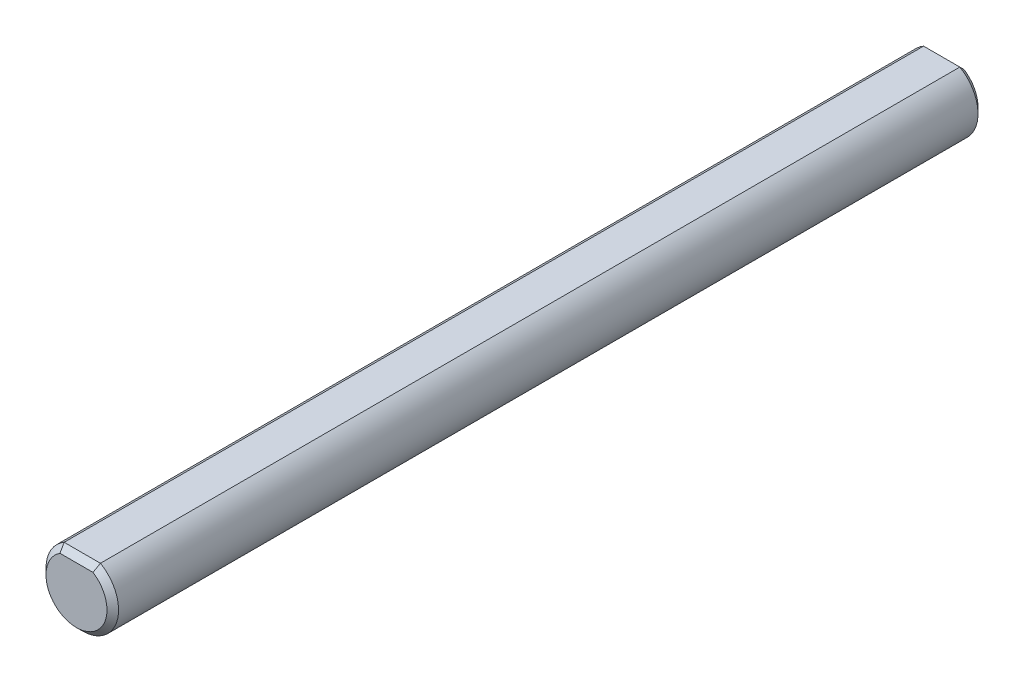
ISO-10303-21;
HEADER;
FILE_DESCRIPTION(('STEP AP214'),'2;1');
FILE_NAME('part.step','',(''),(''),'','','');
FILE_SCHEMA(('AUTOMOTIVE_DESIGN { 1 0 10303 214 1 1 1 1 }'));
ENDSEC;
DATA;
#1=APPLICATION_CONTEXT('core data for automotive mechanical design processes');
#2=APPLICATION_PROTOCOL_DEFINITION('international standard','automotive_design',2000,#1);
#3=PRODUCT_CONTEXT('',#1,'mechanical');
#4=PRODUCT('Part','Part','',(#3));
#5=PRODUCT_RELATED_PRODUCT_CATEGORY('part','',(#4));
#6=PRODUCT_DEFINITION_FORMATION('','',#4);
#7=PRODUCT_DEFINITION_CONTEXT('part definition',#1,'design');
#8=PRODUCT_DEFINITION('design','',#6,#7);
#9=PRODUCT_DEFINITION_SHAPE('','',#8);
#10=(LENGTH_UNIT() NAMED_UNIT(*) SI_UNIT(.MILLI.,.METRE.));
#11=(NAMED_UNIT(*) PLANE_ANGLE_UNIT() SI_UNIT($,.RADIAN.));
#12=(NAMED_UNIT(*) SI_UNIT($,.STERADIAN.) SOLID_ANGLE_UNIT());
#13=UNCERTAINTY_MEASURE_WITH_UNIT(LENGTH_MEASURE(1.E-05),#10,'distance_accuracy_value','');
#14=(GEOMETRIC_REPRESENTATION_CONTEXT(3) GLOBAL_UNCERTAINTY_ASSIGNED_CONTEXT((#13)) GLOBAL_UNIT_ASSIGNED_CONTEXT((#10,
#11,#12)) REPRESENTATION_CONTEXT('',''));
#15=CARTESIAN_POINT('',(0.,0.,0.));
#16=DIRECTION('',(0.,0.,1.));
#17=DIRECTION('',(1.,0.,0.));
#18=AXIS2_PLACEMENT_3D('',#15,#16,#17);
#19=CARTESIAN_POINT('',(0.,0.,76.2));
#20=DIRECTION('',(0.,0.,-1.));
#21=DIRECTION('',(-1.,0.,0.));
#22=AXIS2_PLACEMENT_3D('',#19,#20,#21);
#23=CYLINDRICAL_SURFACE('',#22,3.175);
#24=DIRECTION('',(0.,0.,-1.));
#25=VECTOR('',#24,1.);
#26=CARTESIAN_POINT('',(1.5875,2.74963065701559,76.2));
#27=LINE('',#26,#25);
#28=CARTESIAN_POINT('',(1.5875,2.74963065701559,75.692));
#29=VERTEX_POINT('',#28);
#30=CARTESIAN_POINT('',(1.5875,2.74963065701559,0.508000000000064));
#31=VERTEX_POINT('',#30);
#32=EDGE_CURVE('E109',#29,#31,#27,.T.);
#33=ORIENTED_EDGE('',*,*,#32,.F.);
#34=CARTESIAN_POINT('',(0.,0.,75.692));
#35=DIRECTION('',(0.,0.,1.));
#36=DIRECTION('',(1.,0.,0.));
#37=AXIS2_PLACEMENT_3D('',#34,#35,#36);
#38=CIRCLE('',#37,3.175);
#39=CARTESIAN_POINT('',(-1.5875,2.74963065701559,75.692));
#40=VERTEX_POINT('',#39);
#41=EDGE_CURVE('E125',#29,#40,#38,.F.);
#42=ORIENTED_EDGE('',*,*,#41,.T.);
#43=DIRECTION('',(0.,0.,-1.));
#44=VECTOR('',#43,1.);
#45=CARTESIAN_POINT('',(-1.5875,2.74963065701559,76.2));
#46=LINE('',#45,#44);
#47=CARTESIAN_POINT('',(-1.5875,2.74963065701559,0.508000000000064));
#48=VERTEX_POINT('',#47);
#49=EDGE_CURVE('E168',#40,#48,#46,.T.);
#50=ORIENTED_EDGE('',*,*,#49,.T.);
#51=CARTESIAN_POINT('',(0.,0.,0.508000000000036));
#52=DIRECTION('',(0.,0.,1.));
#53=DIRECTION('',(1.,0.,0.));
#54=AXIS2_PLACEMENT_3D('',#51,#52,#53);
#55=CIRCLE('',#54,3.175);
#56=EDGE_CURVE('E122',#48,#31,#55,.T.);
#57=ORIENTED_EDGE('',*,*,#56,.T.);
#58=EDGE_LOOP('',(#33,#42,#50,#57));
#59=FACE_BOUND('',#58,.T.);
#60=ADVANCED_FACE('F43',(#59),#23,.T.);
#61=CARTESIAN_POINT('',(-1.5875,2.74963065701559,76.2));
#62=DIRECTION('',(0.,-1.,0.));
#63=DIRECTION('',(0.,0.,-1.));
#64=AXIS2_PLACEMENT_3D('',#61,#62,#63);
#65=PLANE('',#64);
#66=ORIENTED_EDGE('',*,*,#49,.F.);
#67=DIRECTION('',(1.,0.,0.));
#68=VECTOR('',#67,1.);
#69=CARTESIAN_POINT('',(1.5875,2.74963065701559,75.692));
#70=LINE('',#69,#68);
#71=EDGE_CURVE('E98',#40,#29,#70,.T.);
#72=ORIENTED_EDGE('',*,*,#71,.T.);
#73=ORIENTED_EDGE('',*,*,#32,.T.);
#74=DIRECTION('',(-1.,0.,0.));
#75=VECTOR('',#74,1.);
#76=CARTESIAN_POINT('',(-1.5875,2.74963065701559,0.508000000000036));
#77=LINE('',#76,#75);
#78=EDGE_CURVE('E113',#31,#48,#77,.T.);
#79=ORIENTED_EDGE('',*,*,#78,.T.);
#80=EDGE_LOOP('',(#66,#72,#73,#79));
#81=FACE_BOUND('',#80,.T.);
#82=ADVANCED_FACE('F176',(#81),#65,.F.);
#83=CARTESIAN_POINT('',(0.,0.,76.2));
#84=DIRECTION('',(0.,0.,1.));
#85=DIRECTION('',(1.,0.,0.));
#86=AXIS2_PLACEMENT_3D('',#83,#84,#85);
#87=PLANE('',#86);
#88=CARTESIAN_POINT('',(0.,0.,76.2));
#89=DIRECTION('',(0.,0.,1.));
#90=DIRECTION('',(1.,0.,0.));
#91=AXIS2_PLACEMENT_3D('',#88,#89,#90);
#92=CIRCLE('',#91,2.66700000000002);
#93=CARTESIAN_POINT('',(-1.44498477415088,2.24163065701561,76.2));
#94=VERTEX_POINT('',#93);
#95=CARTESIAN_POINT('',(1.44498477415088,2.24163065701561,76.2));
#96=VERTEX_POINT('',#95);
#97=EDGE_CURVE('E105',#94,#96,#92,.T.);
#98=ORIENTED_EDGE('',*,*,#97,.T.);
#99=DIRECTION('',(-1.,0.,0.));
#100=VECTOR('',#99,1.);
#101=CARTESIAN_POINT('',(-1.5875,2.24163065701561,76.2));
#102=LINE('',#101,#100);
#103=EDGE_CURVE('E96',#96,#94,#102,.T.);
#104=ORIENTED_EDGE('',*,*,#103,.T.);
#105=EDGE_LOOP('',(#98,#104));
#106=FACE_BOUND('',#105,.T.);
#107=ADVANCED_FACE('F111',(#106),#87,.T.);
#108=CARTESIAN_POINT('',(0.,0.,0.));
#109=DIRECTION('',(0.,0.,1.));
#110=DIRECTION('',(1.,0.,0.));
#111=AXIS2_PLACEMENT_3D('',#108,#109,#110);
#112=PLANE('',#111);
#113=CARTESIAN_POINT('',(0.,0.,0.));
#114=DIRECTION('',(0.,0.,1.));
#115=DIRECTION('',(1.,0.,0.));
#116=AXIS2_PLACEMENT_3D('',#113,#114,#115);
#117=CIRCLE('',#116,2.66699999999996);
#118=CARTESIAN_POINT('',(1.44498477415086,2.24163065701555,0.));
#119=VERTEX_POINT('',#118);
#120=CARTESIAN_POINT('',(-1.44498477415086,2.24163065701555,0.));
#121=VERTEX_POINT('',#120);
#122=EDGE_CURVE('E59',#119,#121,#117,.F.);
#123=ORIENTED_EDGE('',*,*,#122,.T.);
#124=DIRECTION('',(1.,0.,0.));
#125=VECTOR('',#124,1.);
#126=CARTESIAN_POINT('',(0.,2.24163065701555,0.));
#127=LINE('',#126,#125);
#128=EDGE_CURVE('E11',#121,#119,#127,.T.);
#129=ORIENTED_EDGE('',*,*,#128,.T.);
#130=EDGE_LOOP('',(#123,#129));
#131=FACE_BOUND('',#130,.T.);
#132=ADVANCED_FACE('F187',(#131),#112,.F.);
#133=CARTESIAN_POINT('',(0.,0.,76.2));
#134=DIRECTION('',(0.,0.,-1.));
#135=DIRECTION('',(-1.,0.,0.));
#136=AXIS2_PLACEMENT_3D('',#133,#134,#135);
#137=CONICAL_SURFACE('',#136,2.66700000000002,0.785398163397438);
#138=CARTESIAN_POINT('',(-1.44498477415088,2.24163065701561,76.2));
#139=CARTESIAN_POINT('',(-1.46981082100591,2.3261468954951,76.1154837615205));
#140=CARTESIAN_POINT('',(-1.49410013308598,2.41073842223693,76.0308922347787));
#141=CARTESIAN_POINT('',(-1.54160520461424,2.58007175609694,75.8615589009187));
#142=CARTESIAN_POINT('',(-1.56482096781721,2.66481356268844,75.7768170943272));
#143=CARTESIAN_POINT('',(-1.5875,2.74963065701559,75.692));
#144=B_SPLINE_CURVE_WITH_KNOTS('',3,(#138,#139,#140,#141,#142,#143),.UNSPECIFIED.,.F.,.F.,(4,2,
4),(0.,0.366214160388622,0.732427039830236),.UNSPECIFIED.);
#145=EDGE_CURVE('E92',#40,#94,#144,.F.);
#146=ORIENTED_EDGE('',*,*,#145,.F.);
#147=ORIENTED_EDGE('',*,*,#41,.F.);
#148=CARTESIAN_POINT('',(1.5875,2.74963065701559,75.692));
#149=CARTESIAN_POINT('',(1.56482096781721,2.66481356268844,75.7768170943272));
#150=CARTESIAN_POINT('',(1.54160520461424,2.58007175609694,75.8615589009187));
#151=CARTESIAN_POINT('',(1.49410013308598,2.41073842223692,76.0308922347787));
#152=CARTESIAN_POINT('',(1.46981082100591,2.3261468954951,76.1154837615205));
#153=CARTESIAN_POINT('',(1.44498477415087,2.24163065701561,76.2));
#154=B_SPLINE_CURVE_WITH_KNOTS('',3,(#148,#149,#150,#151,#152,#153),.UNSPECIFIED.,.F.,.F.,(4,2,
4),(0.,0.366212879441606,0.732427039830239),.UNSPECIFIED.);
#155=EDGE_CURVE('E102',#96,#29,#154,.F.);
#156=ORIENTED_EDGE('',*,*,#155,.F.);
#157=ORIENTED_EDGE('',*,*,#97,.F.);
#158=EDGE_LOOP('',(#146,#147,#156,#157));
#159=FACE_BOUND('',#158,.T.);
#160=ADVANCED_FACE('F106',(#159),#137,.T.);
#161=CARTESIAN_POINT('',(0.,2.24163065701561,76.2));
#162=DIRECTION('',(0.,0.707106781186555,0.70710678118654));
#163=DIRECTION('',(1.,0.,0.));
#164=AXIS2_PLACEMENT_3D('',#161,#162,#163);
#165=PLANE('',#164);
#166=ORIENTED_EDGE('',*,*,#155,.T.);
#167=ORIENTED_EDGE('',*,*,#71,.F.);
#168=ORIENTED_EDGE('',*,*,#145,.T.);
#169=ORIENTED_EDGE('',*,*,#103,.F.);
#170=EDGE_LOOP('',(#166,#167,#168,#169));
#171=FACE_BOUND('',#170,.T.);
#172=ADVANCED_FACE('F94',(#171),#165,.T.);
#173=CARTESIAN_POINT('',(0.,0.,0.508000000000036));
#174=DIRECTION('',(0.,0.,1.));
#175=DIRECTION('',(1.,0.,0.));
#176=AXIS2_PLACEMENT_3D('',#173,#174,#175);
#177=CONICAL_SURFACE('',#176,3.175,0.785398163397451);
#178=CARTESIAN_POINT('',(-1.5875,2.74963065701559,0.508000000000064));
#179=CARTESIAN_POINT('',(-1.56482096781721,2.66481356268844,0.423182905672898));
#180=CARTESIAN_POINT('',(-1.54160520461424,2.58007175609693,0.338441099081383));
#181=CARTESIAN_POINT('',(-1.49410013308598,2.4107384222369,0.169107765221341));
#182=CARTESIAN_POINT('',(-1.4698108210059,2.32614689549506,0.0845162384795016));
#183=CARTESIAN_POINT('',(-1.44498477415086,2.24163065701555,0.));
#184=B_SPLINE_CURVE_WITH_KNOTS('',3,(#178,#179,#180,#181,#182,#183),.UNSPECIFIED.,.F.,.F.,(4,2,
4),(0.,0.366212879441646,0.732427039830328),.UNSPECIFIED.);
#185=EDGE_CURVE('E157',#121,#48,#184,.F.);
#186=ORIENTED_EDGE('',*,*,#185,.F.);
#187=ORIENTED_EDGE('',*,*,#122,.F.);
#188=CARTESIAN_POINT('',(1.44498477415086,2.24163065701555,0.));
#189=CARTESIAN_POINT('',(1.4698108210059,2.32614689549506,0.0845162384795039));
#190=CARTESIAN_POINT('',(1.49410013308598,2.4107384222369,0.169107765221343));
#191=CARTESIAN_POINT('',(1.54160520461424,2.58007175609694,0.33844109908138));
#192=CARTESIAN_POINT('',(1.56482096781721,2.66481356268845,0.42318290567289));
#193=CARTESIAN_POINT('',(1.5875,2.74963065701561,0.508000000000049));
#194=B_SPLINE_CURVE_WITH_KNOTS('',3,(#188,#189,#190,#191,#192,#193),.UNSPECIFIED.,.F.,.F.,(4,2,
4),(0.,0.366214160388682,0.732427039830328),.UNSPECIFIED.);
#195=EDGE_CURVE('E49',#31,#119,#194,.F.);
#196=ORIENTED_EDGE('',*,*,#195,.F.);
#197=ORIENTED_EDGE('',*,*,#56,.F.);
#198=EDGE_LOOP('',(#186,#187,#196,#197));
#199=FACE_BOUND('',#198,.T.);
#200=ADVANCED_FACE('F148',(#199),#177,.T.);
#201=CARTESIAN_POINT('',(-1.5875,2.74963065701559,0.508000000000036));
#202=DIRECTION('',(0.,-0.707106781186546,0.707106781186549));
#203=DIRECTION('',(-1.,0.,0.));
#204=AXIS2_PLACEMENT_3D('',#201,#202,#203);
#205=PLANE('',#204);
#206=ORIENTED_EDGE('',*,*,#195,.T.);
#207=ORIENTED_EDGE('',*,*,#128,.F.);
#208=ORIENTED_EDGE('',*,*,#185,.T.);
#209=ORIENTED_EDGE('',*,*,#78,.F.);
#210=EDGE_LOOP('',(#206,#207,#208,#209));
#211=FACE_BOUND('',#210,.T.);
#212=ADVANCED_FACE('F46',(#211),#205,.F.);
#213=CLOSED_SHELL('',(#60,#82,#107,#132,#160,#172,#200,#212));
#214=MANIFOLD_SOLID_BREP('B2',#213);
#215=ADVANCED_BREP_SHAPE_REPRESENTATION('',(#18,#214),#14);
#216=SHAPE_DEFINITION_REPRESENTATION(#9,#215);
ENDSEC;
END-ISO-10303-21;
